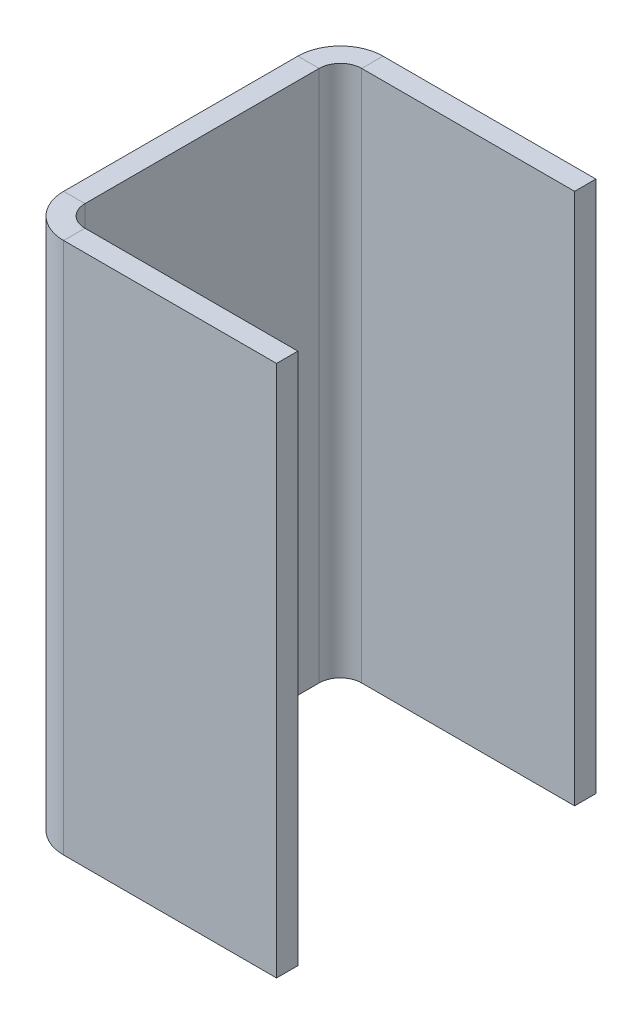
ISO-10303-21;
HEADER;
FILE_DESCRIPTION(('STEP AP214'),'2;1');
FILE_NAME('part.step','',(''),(''),'','','');
FILE_SCHEMA(('AUTOMOTIVE_DESIGN { 1 0 10303 214 1 1 1 1 }'));
ENDSEC;
DATA;
#1=APPLICATION_CONTEXT('core data for automotive mechanical design processes');
#2=APPLICATION_PROTOCOL_DEFINITION('international standard','automotive_design',2000,#1);
#3=PRODUCT_CONTEXT('',#1,'mechanical');
#4=PRODUCT('Part','Part','',(#3));
#5=PRODUCT_RELATED_PRODUCT_CATEGORY('part','',(#4));
#6=PRODUCT_DEFINITION_FORMATION('','',#4);
#7=PRODUCT_DEFINITION_CONTEXT('part definition',#1,'design');
#8=PRODUCT_DEFINITION('design','',#6,#7);
#9=PRODUCT_DEFINITION_SHAPE('','',#8);
#10=(LENGTH_UNIT() NAMED_UNIT(*) SI_UNIT(.MILLI.,.METRE.));
#11=(NAMED_UNIT(*) PLANE_ANGLE_UNIT() SI_UNIT($,.RADIAN.));
#12=(NAMED_UNIT(*) SI_UNIT($,.STERADIAN.) SOLID_ANGLE_UNIT());
#13=UNCERTAINTY_MEASURE_WITH_UNIT(LENGTH_MEASURE(1.E-05),#10,'distance_accuracy_value','');
#14=(GEOMETRIC_REPRESENTATION_CONTEXT(3) GLOBAL_UNCERTAINTY_ASSIGNED_CONTEXT((#13)) GLOBAL_UNIT_ASSIGNED_CONTEXT((#10,
#11,#12)) REPRESENTATION_CONTEXT('',''));
#15=CARTESIAN_POINT('',(0.,0.,0.));
#16=DIRECTION('',(0.,0.,1.));
#17=DIRECTION('',(1.,0.,0.));
#18=AXIS2_PLACEMENT_3D('',#15,#16,#17);
#19=CARTESIAN_POINT('',(-930.000000000004,-16.5000000000063,-525.));
#20=DIRECTION('',(0.,1.,0.));
#21=DIRECTION('',(0.,0.,1.));
#22=AXIS2_PLACEMENT_3D('',#19,#20,#21);
#23=PLANE('',#22);
#24=DIRECTION('',(1.,0.,0.));
#25=VECTOR('',#24,1.);
#26=CARTESIAN_POINT('',(-932.000000000004,-16.5000000000063,-525.));
#27=LINE('',#26,#25);
#28=CARTESIAN_POINT('',(-934.000000000004,-16.5000000000063,-525.));
#29=VERTEX_POINT('',#28);
#30=CARTESIAN_POINT('',(-932.000000000004,-16.5000000000063,-525.));
#31=VERTEX_POINT('',#30);
#32=EDGE_CURVE('E11',#29,#31,#27,.T.);
#33=ORIENTED_EDGE('',*,*,#32,.F.);
#34=CARTESIAN_POINT('',(-930.000000000004,-16.5000000000063,-525.));
#35=DIRECTION('',(0.,-1.,0.));
#36=DIRECTION('',(0.,0.,-1.));
#37=AXIS2_PLACEMENT_3D('',#34,#35,#36);
#38=CIRCLE('',#37,4.00000000000002);
#39=CARTESIAN_POINT('',(-930.000000425374,-16.5000000000063,-529.));
#40=VERTEX_POINT('',#39);
#41=EDGE_CURVE('E103',#29,#40,#38,.T.);
#42=ORIENTED_EDGE('',*,*,#41,.T.);
#43=DIRECTION('',(0.,0.,1.));
#44=VECTOR('',#43,1.);
#45=CARTESIAN_POINT('',(-930.000000425374,-16.5000000000063,-527.));
#46=LINE('',#45,#44);
#47=CARTESIAN_POINT('',(-930.000000425374,-16.5000000000063,-527.));
#48=VERTEX_POINT('',#47);
#49=EDGE_CURVE('E51',#40,#48,#46,.T.);
#50=ORIENTED_EDGE('',*,*,#49,.T.);
#51=CARTESIAN_POINT('',(-930.000000000004,-16.5000000000063,-525.));
#52=DIRECTION('',(0.,-1.,0.));
#53=DIRECTION('',(0.,0.,1.));
#54=AXIS2_PLACEMENT_3D('',#51,#52,#53);
#55=CIRCLE('',#54,2.00000000000002);
#56=EDGE_CURVE('E106',#31,#48,#55,.T.);
#57=ORIENTED_EDGE('',*,*,#56,.F.);
#58=EDGE_LOOP('',(#33,#42,#50,#57));
#59=FACE_BOUND('',#58,.T.);
#60=ADVANCED_FACE('F41',(#59),#23,.F.);
#61=CARTESIAN_POINT('',(-930.000000425374,-16.5000000000063,-527.));
#62=DIRECTION('',(0.,-1.,0.));
#63=DIRECTION('',(1.,0.,0.));
#64=AXIS2_PLACEMENT_3D('',#61,#62,#63);
#65=PLANE('',#64);
#66=ORIENTED_EDGE('',*,*,#49,.F.);
#67=DIRECTION('',(-1.,0.,0.));
#68=VECTOR('',#67,1.);
#69=CARTESIAN_POINT('',(-930.000000425374,-16.5000000000063,-529.));
#70=LINE('',#69,#68);
#71=CARTESIAN_POINT('',(-910.000000000005,-16.5000000000063,-529.));
#72=VERTEX_POINT('',#71);
#73=EDGE_CURVE('E141',#40,#72,#70,.F.);
#74=ORIENTED_EDGE('',*,*,#73,.T.);
#75=DIRECTION('',(0.,0.,1.));
#76=VECTOR('',#75,1.);
#77=CARTESIAN_POINT('',(-910.000000000005,-16.5000000000063,-527.));
#78=LINE('',#77,#76);
#79=CARTESIAN_POINT('',(-910.000000000005,-16.5000000000063,-527.));
#80=VERTEX_POINT('',#79);
#81=EDGE_CURVE('E169',#72,#80,#78,.T.);
#82=ORIENTED_EDGE('',*,*,#81,.T.);
#83=DIRECTION('',(1.,0.,0.));
#84=VECTOR('',#83,1.);
#85=CARTESIAN_POINT('',(-930.000000425374,-16.5000000000063,-527.));
#86=LINE('',#85,#84);
#87=EDGE_CURVE('E191',#48,#80,#86,.T.);
#88=ORIENTED_EDGE('',*,*,#87,.F.);
#89=EDGE_LOOP('',(#66,#74,#82,#88));
#90=FACE_BOUND('',#89,.T.);
#91=ADVANCED_FACE('F192',(#90),#65,.T.);
#92=CARTESIAN_POINT('',(-910.000000000005,33.4999999999937,-527.));
#93=DIRECTION('',(1.,0.,0.));
#94=DIRECTION('',(0.,1.,0.));
#95=AXIS2_PLACEMENT_3D('',#92,#93,#94);
#96=PLANE('',#95);
#97=ORIENTED_EDGE('',*,*,#81,.F.);
#98=DIRECTION('',(0.,1.,0.));
#99=VECTOR('',#98,1.);
#100=CARTESIAN_POINT('',(-910.000000000005,33.4999999999937,-529.));
#101=LINE('',#100,#99);
#102=CARTESIAN_POINT('',(-910.000000000005,33.4999999999955,-529.));
#103=VERTEX_POINT('',#102);
#104=EDGE_CURVE('E283',#72,#103,#101,.T.);
#105=ORIENTED_EDGE('',*,*,#104,.T.);
#106=DIRECTION('',(0.,0.,1.));
#107=VECTOR('',#106,1.);
#108=CARTESIAN_POINT('',(-910.000000000005,33.4999999999955,-527.));
#109=LINE('',#108,#107);
#110=CARTESIAN_POINT('',(-910.000000000005,33.4999999999955,-527.));
#111=VERTEX_POINT('',#110);
#112=EDGE_CURVE('E166',#103,#111,#109,.T.);
#113=ORIENTED_EDGE('',*,*,#112,.T.);
#114=DIRECTION('',(0.,1.,0.));
#115=VECTOR('',#114,1.);
#116=CARTESIAN_POINT('',(-910.000000000005,33.4999999999937,-527.));
#117=LINE('',#116,#115);
#118=EDGE_CURVE('E208',#80,#111,#117,.T.);
#119=ORIENTED_EDGE('',*,*,#118,.F.);
#120=EDGE_LOOP('',(#97,#105,#113,#119));
#121=FACE_BOUND('',#120,.T.);
#122=ADVANCED_FACE('F289',(#121),#96,.T.);
#123=CARTESIAN_POINT('',(-930.000000425374,33.4999999999937,-527.));
#124=DIRECTION('',(0.,-1.,0.));
#125=DIRECTION('',(1.,0.,0.));
#126=AXIS2_PLACEMENT_3D('',#123,#124,#125);
#127=PLANE('',#126);
#128=ORIENTED_EDGE('',*,*,#112,.F.);
#129=DIRECTION('',(-1.,0.,0.));
#130=VECTOR('',#129,1.);
#131=CARTESIAN_POINT('',(-930.000000425374,33.4999999999937,-529.));
#132=LINE('',#131,#130);
#133=CARTESIAN_POINT('',(-930.000000425374,33.4999999999937,-529.));
#134=VERTEX_POINT('',#133);
#135=EDGE_CURVE('E258',#134,#103,#132,.F.);
#136=ORIENTED_EDGE('',*,*,#135,.F.);
#137=DIRECTION('',(2.12684814204773E-07,0.,0.999999999999977));
#138=VECTOR('',#137,1.);
#139=CARTESIAN_POINT('',(-930.000000425374,33.4999999999937,-527.));
#140=LINE('',#139,#138);
#141=CARTESIAN_POINT('',(-930.000000425374,33.4999999999937,-527.));
#142=VERTEX_POINT('',#141);
#143=EDGE_CURVE('E163',#134,#142,#140,.T.);
#144=ORIENTED_EDGE('',*,*,#143,.T.);
#145=DIRECTION('',(1.,0.,0.));
#146=VECTOR('',#145,1.);
#147=CARTESIAN_POINT('',(-930.000000425374,33.4999999999937,-527.));
#148=LINE('',#147,#146);
#149=EDGE_CURVE('E202',#142,#111,#148,.T.);
#150=ORIENTED_EDGE('',*,*,#149,.T.);
#151=EDGE_LOOP('',(#128,#136,#144,#150));
#152=FACE_BOUND('',#151,.T.);
#153=ADVANCED_FACE('F294',(#152),#127,.F.);
#154=CARTESIAN_POINT('',(-930.000000000004,33.4999999999937,-525.));
#155=DIRECTION('',(0.,1.,0.));
#156=DIRECTION('',(0.,0.,1.));
#157=AXIS2_PLACEMENT_3D('',#154,#155,#156);
#158=PLANE('',#157);
#159=ORIENTED_EDGE('',*,*,#143,.F.);
#160=CARTESIAN_POINT('',(-930.000000000004,33.4999999999937,-525.));
#161=DIRECTION('',(0.,-1.,0.));
#162=DIRECTION('',(0.,0.,-1.));
#163=AXIS2_PLACEMENT_3D('',#160,#161,#162);
#164=CIRCLE('',#163,4.00000000000002);
#165=CARTESIAN_POINT('',(-934.000000000004,33.4999999999937,-525.));
#166=VERTEX_POINT('',#165);
#167=EDGE_CURVE('E134',#166,#134,#164,.T.);
#168=ORIENTED_EDGE('',*,*,#167,.F.);
#169=DIRECTION('',(1.,0.,0.));
#170=VECTOR('',#169,1.);
#171=CARTESIAN_POINT('',(-932.000000000004,33.4999999999937,-525.));
#172=LINE('',#171,#170);
#173=CARTESIAN_POINT('',(-932.000000000004,33.4999999999937,-525.));
#174=VERTEX_POINT('',#173);
#175=EDGE_CURVE('E160',#166,#174,#172,.T.);
#176=ORIENTED_EDGE('',*,*,#175,.T.);
#177=CARTESIAN_POINT('',(-930.000000000004,33.4999999999937,-525.));
#178=DIRECTION('',(0.,-1.,0.));
#179=DIRECTION('',(0.,0.,1.));
#180=AXIS2_PLACEMENT_3D('',#177,#178,#179);
#181=CIRCLE('',#180,2.00000000000002);
#182=EDGE_CURVE('E187',#174,#142,#181,.T.);
#183=ORIENTED_EDGE('',*,*,#182,.T.);
#184=EDGE_LOOP('',(#159,#168,#176,#183));
#185=FACE_BOUND('',#184,.T.);
#186=ADVANCED_FACE('F339',(#185),#158,.T.);
#187=CARTESIAN_POINT('',(-932.000000000004,33.4999999999937,-525.));
#188=DIRECTION('',(0.,-1.,0.));
#189=DIRECTION('',(0.,0.,-1.));
#190=AXIS2_PLACEMENT_3D('',#187,#188,#189);
#191=PLANE('',#190);
#192=ORIENTED_EDGE('',*,*,#175,.F.);
#193=DIRECTION('',(0.,0.,1.));
#194=VECTOR('',#193,1.);
#195=CARTESIAN_POINT('',(-934.000000000004,33.4999999999938,-525.));
#196=LINE('',#195,#194);
#197=CARTESIAN_POINT('',(-934.000000000004,33.4999999999938,-503.));
#198=VERTEX_POINT('',#197);
#199=EDGE_CURVE('E122',#198,#166,#196,.F.);
#200=ORIENTED_EDGE('',*,*,#199,.F.);
#201=DIRECTION('',(1.,0.,0.));
#202=VECTOR('',#201,1.);
#203=CARTESIAN_POINT('',(-932.000000000005,33.4999999999938,-503.));
#204=LINE('',#203,#202);
#205=CARTESIAN_POINT('',(-932.000000000005,33.4999999999938,-503.));
#206=VERTEX_POINT('',#205);
#207=EDGE_CURVE('E157',#198,#206,#204,.T.);
#208=ORIENTED_EDGE('',*,*,#207,.T.);
#209=DIRECTION('',(0.,0.,-1.));
#210=VECTOR('',#209,1.);
#211=CARTESIAN_POINT('',(-932.000000000004,33.4999999999937,-525.));
#212=LINE('',#211,#210);
#213=EDGE_CURVE('E216',#206,#174,#212,.T.);
#214=ORIENTED_EDGE('',*,*,#213,.T.);
#215=EDGE_LOOP('',(#192,#200,#208,#214));
#216=FACE_BOUND('',#215,.T.);
#217=ADVANCED_FACE('F336',(#216),#191,.F.);
#218=CARTESIAN_POINT('',(-930.000000000004,33.4999999999938,-503.));
#219=DIRECTION('',(0.,1.,0.));
#220=DIRECTION('',(0.,0.,1.));
#221=AXIS2_PLACEMENT_3D('',#218,#219,#220);
#222=PLANE('',#221);
#223=ORIENTED_EDGE('',*,*,#207,.F.);
#224=CARTESIAN_POINT('',(-930.000000000004,33.4999999999938,-503.));
#225=DIRECTION('',(0.,-1.,0.));
#226=DIRECTION('',(0.,0.,-1.));
#227=AXIS2_PLACEMENT_3D('',#224,#225,#226);
#228=CIRCLE('',#227,4.00000000000002);
#229=CARTESIAN_POINT('',(-930.000000425374,33.4999999999938,-499.));
#230=VERTEX_POINT('',#229);
#231=EDGE_CURVE('E262',#230,#198,#228,.T.);
#232=ORIENTED_EDGE('',*,*,#231,.F.);
#233=DIRECTION('',(0.,0.,-1.));
#234=VECTOR('',#233,1.);
#235=CARTESIAN_POINT('',(-930.000000425374,33.4999999999938,-501.));
#236=LINE('',#235,#234);
#237=CARTESIAN_POINT('',(-930.000000425374,33.4999999999938,-501.));
#238=VERTEX_POINT('',#237);
#239=EDGE_CURVE('E155',#230,#238,#236,.T.);
#240=ORIENTED_EDGE('',*,*,#239,.T.);
#241=CARTESIAN_POINT('',(-930.000000000004,33.4999999999938,-503.));
#242=DIRECTION('',(0.,-1.,0.));
#243=DIRECTION('',(0.,0.,-1.));
#244=AXIS2_PLACEMENT_3D('',#241,#242,#243);
#245=CIRCLE('',#244,2.00000000000002);
#246=EDGE_CURVE('E244',#238,#206,#245,.T.);
#247=ORIENTED_EDGE('',*,*,#246,.T.);
#248=EDGE_LOOP('',(#223,#232,#240,#247));
#249=FACE_BOUND('',#248,.T.);
#250=ADVANCED_FACE('F323',(#249),#222,.T.);
#251=CARTESIAN_POINT('',(-930.000000425374,33.4999999999938,-501.));
#252=DIRECTION('',(0.,-1.,0.));
#253=DIRECTION('',(-1.,0.,0.));
#254=AXIS2_PLACEMENT_3D('',#251,#252,#253);
#255=PLANE('',#254);
#256=ORIENTED_EDGE('',*,*,#239,.F.);
#257=DIRECTION('',(-1.,0.,0.));
#258=VECTOR('',#257,1.);
#259=CARTESIAN_POINT('',(-930.000000425374,33.4999999999955,-499.));
#260=LINE('',#259,#258);
#261=CARTESIAN_POINT('',(-910.000000000004,33.4999999999955,-499.));
#262=VERTEX_POINT('',#261);
#263=EDGE_CURVE('E253',#262,#230,#260,.T.);
#264=ORIENTED_EDGE('',*,*,#263,.F.);
#265=DIRECTION('',(0.,0.,-1.));
#266=VECTOR('',#265,1.);
#267=CARTESIAN_POINT('',(-910.000000000004,33.4999999999955,-501.));
#268=LINE('',#267,#266);
#269=CARTESIAN_POINT('',(-910.000000000004,33.4999999999955,-501.));
#270=VERTEX_POINT('',#269);
#271=EDGE_CURVE('E59',#262,#270,#268,.T.);
#272=ORIENTED_EDGE('',*,*,#271,.T.);
#273=DIRECTION('',(-1.,0.,0.));
#274=VECTOR('',#273,1.);
#275=CARTESIAN_POINT('',(-930.000000425374,33.4999999999938,-501.));
#276=LINE('',#275,#274);
#277=EDGE_CURVE('E237',#270,#238,#276,.T.);
#278=ORIENTED_EDGE('',*,*,#277,.T.);
#279=EDGE_LOOP('',(#256,#264,#272,#278));
#280=FACE_BOUND('',#279,.T.);
#281=ADVANCED_FACE('F326',(#280),#255,.F.);
#282=CARTESIAN_POINT('',(-910.000000000004,33.4999999999938,-501.));
#283=DIRECTION('',(1.,0.,0.));
#284=DIRECTION('',(0.,-1.,0.));
#285=AXIS2_PLACEMENT_3D('',#282,#283,#284);
#286=PLANE('',#285);
#287=ORIENTED_EDGE('',*,*,#271,.F.);
#288=DIRECTION('',(0.,-1.,0.));
#289=VECTOR('',#288,1.);
#290=CARTESIAN_POINT('',(-910.000000000004,33.4999999999938,-499.));
#291=LINE('',#290,#289);
#292=CARTESIAN_POINT('',(-910.000000000005,-16.5000000000062,-499.));
#293=VERTEX_POINT('',#292);
#294=EDGE_CURVE('E266',#262,#293,#291,.T.);
#295=ORIENTED_EDGE('',*,*,#294,.T.);
#296=DIRECTION('',(0.,0.,-1.));
#297=VECTOR('',#296,1.);
#298=CARTESIAN_POINT('',(-910.000000000005,-16.5000000000062,-501.));
#299=LINE('',#298,#297);
#300=CARTESIAN_POINT('',(-910.000000000005,-16.5000000000062,-501.));
#301=VERTEX_POINT('',#300);
#302=EDGE_CURVE('E151',#293,#301,#299,.T.);
#303=ORIENTED_EDGE('',*,*,#302,.T.);
#304=DIRECTION('',(0.,-1.,0.));
#305=VECTOR('',#304,1.);
#306=CARTESIAN_POINT('',(-910.000000000004,33.4999999999938,-501.));
#307=LINE('',#306,#305);
#308=EDGE_CURVE('E225',#270,#301,#307,.T.);
#309=ORIENTED_EDGE('',*,*,#308,.F.);
#310=EDGE_LOOP('',(#287,#295,#303,#309));
#311=FACE_BOUND('',#310,.T.);
#312=ADVANCED_FACE('F328',(#311),#286,.T.);
#313=CARTESIAN_POINT('',(-930.000000425374,-16.5000000000062,-501.));
#314=DIRECTION('',(0.,-1.,0.));
#315=DIRECTION('',(-1.,0.,0.));
#316=AXIS2_PLACEMENT_3D('',#313,#314,#315);
#317=PLANE('',#316);
#318=ORIENTED_EDGE('',*,*,#302,.F.);
#319=DIRECTION('',(-1.,0.,0.));
#320=VECTOR('',#319,1.);
#321=CARTESIAN_POINT('',(-930.000000425374,-16.5000000000062,-499.));
#322=LINE('',#321,#320);
#323=CARTESIAN_POINT('',(-930.000000425374,-16.5000000000062,-499.));
#324=VERTEX_POINT('',#323);
#325=EDGE_CURVE('E254',#293,#324,#322,.T.);
#326=ORIENTED_EDGE('',*,*,#325,.T.);
#327=DIRECTION('',(2.12684814204773E-07,0.,-0.999999999999977));
#328=VECTOR('',#327,1.);
#329=CARTESIAN_POINT('',(-930.000000425374,-16.5000000000062,-501.));
#330=LINE('',#329,#328);
#331=CARTESIAN_POINT('',(-930.000000425374,-16.5000000000062,-501.));
#332=VERTEX_POINT('',#331);
#333=EDGE_CURVE('E148',#324,#332,#330,.T.);
#334=ORIENTED_EDGE('',*,*,#333,.T.);
#335=DIRECTION('',(-1.,0.,0.));
#336=VECTOR('',#335,1.);
#337=CARTESIAN_POINT('',(-930.000000425374,-16.5000000000062,-501.));
#338=LINE('',#337,#336);
#339=EDGE_CURVE('E229',#301,#332,#338,.T.);
#340=ORIENTED_EDGE('',*,*,#339,.F.);
#341=EDGE_LOOP('',(#318,#326,#334,#340));
#342=FACE_BOUND('',#341,.T.);
#343=ADVANCED_FACE('F309',(#342),#317,.T.);
#344=CARTESIAN_POINT('',(-930.000000000004,-16.5000000000062,-503.));
#345=DIRECTION('',(0.,1.,0.));
#346=DIRECTION('',(0.,0.,1.));
#347=AXIS2_PLACEMENT_3D('',#344,#345,#346);
#348=PLANE('',#347);
#349=ORIENTED_EDGE('',*,*,#333,.F.);
#350=CARTESIAN_POINT('',(-930.000000000004,-16.5000000000062,-503.));
#351=DIRECTION('',(0.,-1.,0.));
#352=DIRECTION('',(0.,0.,-1.));
#353=AXIS2_PLACEMENT_3D('',#350,#351,#352);
#354=CIRCLE('',#353,4.00000000000002);
#355=CARTESIAN_POINT('',(-934.000000000005,-16.5000000000062,-503.));
#356=VERTEX_POINT('',#355);
#357=EDGE_CURVE('E259',#324,#356,#354,.T.);
#358=ORIENTED_EDGE('',*,*,#357,.T.);
#359=DIRECTION('',(1.,0.,0.));
#360=VECTOR('',#359,1.);
#361=CARTESIAN_POINT('',(-932.000000000005,-16.5000000000062,-503.));
#362=LINE('',#361,#360);
#363=CARTESIAN_POINT('',(-932.000000000005,-16.5000000000062,-503.));
#364=VERTEX_POINT('',#363);
#365=EDGE_CURVE('E45',#356,#364,#362,.T.);
#366=ORIENTED_EDGE('',*,*,#365,.T.);
#367=CARTESIAN_POINT('',(-930.000000000004,-16.5000000000062,-503.));
#368=DIRECTION('',(0.,-1.,0.));
#369=DIRECTION('',(0.,0.,-1.));
#370=AXIS2_PLACEMENT_3D('',#367,#368,#369);
#371=CIRCLE('',#370,2.00000000000002);
#372=EDGE_CURVE('E240',#332,#364,#371,.T.);
#373=ORIENTED_EDGE('',*,*,#372,.F.);
#374=EDGE_LOOP('',(#349,#358,#366,#373));
#375=FACE_BOUND('',#374,.T.);
#376=ADVANCED_FACE('F317',(#375),#348,.F.);
#377=CARTESIAN_POINT('',(-932.000000000004,-16.5000000000063,-525.));
#378=DIRECTION('',(0.,-1.,0.));
#379=DIRECTION('',(0.,0.,-1.));
#380=AXIS2_PLACEMENT_3D('',#377,#378,#379);
#381=PLANE('',#380);
#382=DIRECTION('',(0.,0.,1.));
#383=VECTOR('',#382,1.);
#384=CARTESIAN_POINT('',(-934.000000000004,-16.5000000000062,-525.));
#385=LINE('',#384,#383);
#386=EDGE_CURVE('E119',#356,#29,#385,.F.);
#387=ORIENTED_EDGE('',*,*,#386,.T.);
#388=ORIENTED_EDGE('',*,*,#32,.T.);
#389=DIRECTION('',(0.,0.,-1.));
#390=VECTOR('',#389,1.);
#391=CARTESIAN_POINT('',(-932.000000000004,-16.5000000000063,-525.));
#392=LINE('',#391,#390);
#393=EDGE_CURVE('E197',#364,#31,#392,.T.);
#394=ORIENTED_EDGE('',*,*,#393,.F.);
#395=ORIENTED_EDGE('',*,*,#365,.F.);
#396=EDGE_LOOP('',(#387,#388,#394,#395));
#397=FACE_BOUND('',#396,.T.);
#398=ADVANCED_FACE('F43',(#397),#381,.T.);
#399=CARTESIAN_POINT('',(-930.000000000004,33.4999999999938,-503.));
#400=DIRECTION('',(0.,-1.,0.));
#401=DIRECTION('',(0.,0.,1.));
#402=AXIS2_PLACEMENT_3D('',#399,#400,#401);
#403=CYLINDRICAL_SURFACE('',#402,2.00000000000002);
#404=ORIENTED_EDGE('',*,*,#372,.T.);
#405=DIRECTION('',(0.,-1.,0.));
#406=VECTOR('',#405,1.);
#407=CARTESIAN_POINT('',(-932.000000000005,33.4999999999938,-503.));
#408=LINE('',#407,#406);
#409=EDGE_CURVE('E188',#206,#364,#408,.T.);
#410=ORIENTED_EDGE('',*,*,#409,.F.);
#411=ORIENTED_EDGE('',*,*,#246,.F.);
#412=DIRECTION('',(0.,-1.,0.));
#413=VECTOR('',#412,1.);
#414=CARTESIAN_POINT('',(-930.000000425374,33.4999999999938,-501.));
#415=LINE('',#414,#413);
#416=EDGE_CURVE('E233',#238,#332,#415,.T.);
#417=ORIENTED_EDGE('',*,*,#416,.T.);
#418=EDGE_LOOP('',(#404,#410,#411,#417));
#419=FACE_BOUND('',#418,.T.);
#420=ADVANCED_FACE('F321',(#419),#403,.F.);
#421=CARTESIAN_POINT('',(-930.000000425374,33.4999999999938,-501.));
#422=DIRECTION('',(0.,0.,-1.));
#423=DIRECTION('',(0.,-1.,0.));
#424=AXIS2_PLACEMENT_3D('',#421,#422,#423);
#425=PLANE('',#424);
#426=ORIENTED_EDGE('',*,*,#308,.T.);
#427=ORIENTED_EDGE('',*,*,#339,.T.);
#428=ORIENTED_EDGE('',*,*,#416,.F.);
#429=ORIENTED_EDGE('',*,*,#277,.F.);
#430=EDGE_LOOP('',(#426,#427,#428,#429));
#431=FACE_BOUND('',#430,.T.);
#432=ADVANCED_FACE('F315',(#431),#425,.T.);
#433=CARTESIAN_POINT('',(-930.000000000004,33.4999999999937,-525.));
#434=DIRECTION('',(0.,-1.,0.));
#435=DIRECTION('',(0.,0.,1.));
#436=AXIS2_PLACEMENT_3D('',#433,#434,#435);
#437=CYLINDRICAL_SURFACE('',#436,2.00000000000002);
#438=ORIENTED_EDGE('',*,*,#56,.T.);
#439=DIRECTION('',(0.,-1.,0.));
#440=VECTOR('',#439,1.);
#441=CARTESIAN_POINT('',(-930.000000425374,33.4999999999937,-527.));
#442=LINE('',#441,#440);
#443=EDGE_CURVE('E183',#142,#48,#442,.T.);
#444=ORIENTED_EDGE('',*,*,#443,.F.);
#445=ORIENTED_EDGE('',*,*,#182,.F.);
#446=DIRECTION('',(0.,-1.,0.));
#447=VECTOR('',#446,1.);
#448=CARTESIAN_POINT('',(-932.000000000004,33.4999999999937,-525.));
#449=LINE('',#448,#447);
#450=EDGE_CURVE('E185',#174,#31,#449,.T.);
#451=ORIENTED_EDGE('',*,*,#450,.T.);
#452=EDGE_LOOP('',(#438,#444,#445,#451));
#453=FACE_BOUND('',#452,.T.);
#454=ADVANCED_FACE('F180',(#453),#437,.F.);
#455=CARTESIAN_POINT('',(-932.000000000004,33.4999999999937,-525.));
#456=DIRECTION('',(1.,0.,0.));
#457=DIRECTION('',(0.,0.,1.));
#458=AXIS2_PLACEMENT_3D('',#455,#456,#457);
#459=PLANE('',#458);
#460=ORIENTED_EDGE('',*,*,#393,.T.);
#461=ORIENTED_EDGE('',*,*,#450,.F.);
#462=ORIENTED_EDGE('',*,*,#213,.F.);
#463=ORIENTED_EDGE('',*,*,#409,.T.);
#464=EDGE_LOOP('',(#460,#461,#462,#463));
#465=FACE_BOUND('',#464,.T.);
#466=ADVANCED_FACE('F535',(#465),#459,.T.);
#467=CARTESIAN_POINT('',(-930.000000425374,33.4999999999937,-527.));
#468=DIRECTION('',(0.,0.,1.));
#469=DIRECTION('',(0.,1.,0.));
#470=AXIS2_PLACEMENT_3D('',#467,#468,#469);
#471=PLANE('',#470);
#472=ORIENTED_EDGE('',*,*,#118,.T.);
#473=ORIENTED_EDGE('',*,*,#149,.F.);
#474=ORIENTED_EDGE('',*,*,#443,.T.);
#475=ORIENTED_EDGE('',*,*,#87,.T.);
#476=EDGE_LOOP('',(#472,#473,#474,#475));
#477=FACE_BOUND('',#476,.T.);
#478=ADVANCED_FACE('F200',(#477),#471,.T.);
#479=CARTESIAN_POINT('',(-930.000000000004,33.4999999999938,-503.));
#480=DIRECTION('',(0.,-1.,0.));
#481=DIRECTION('',(0.,0.,1.));
#482=AXIS2_PLACEMENT_3D('',#479,#480,#481);
#483=CYLINDRICAL_SURFACE('',#482,4.00000000000002);
#484=ORIENTED_EDGE('',*,*,#357,.F.);
#485=DIRECTION('',(0.,-1.,0.));
#486=VECTOR('',#485,1.);
#487=CARTESIAN_POINT('',(-930.000000850744,33.4999999999938,-499.));
#488=LINE('',#487,#486);
#489=EDGE_CURVE('E250',#230,#324,#488,.T.);
#490=ORIENTED_EDGE('',*,*,#489,.F.);
#491=ORIENTED_EDGE('',*,*,#231,.T.);
#492=DIRECTION('',(0.,-1.,0.));
#493=VECTOR('',#492,1.);
#494=CARTESIAN_POINT('',(-934.000000000004,33.4999999999937,-503.));
#495=LINE('',#494,#493);
#496=EDGE_CURVE('E135',#198,#356,#495,.T.);
#497=ORIENTED_EDGE('',*,*,#496,.T.);
#498=EDGE_LOOP('',(#484,#490,#491,#497));
#499=FACE_BOUND('',#498,.T.);
#500=ADVANCED_FACE('F334',(#499),#483,.T.);
#501=CARTESIAN_POINT('',(-930.000000425374,33.4999999999938,-499.));
#502=DIRECTION('',(0.,0.,-1.));
#503=DIRECTION('',(0.,-1.,0.));
#504=AXIS2_PLACEMENT_3D('',#501,#502,#503);
#505=PLANE('',#504);
#506=ORIENTED_EDGE('',*,*,#294,.F.);
#507=ORIENTED_EDGE('',*,*,#263,.T.);
#508=ORIENTED_EDGE('',*,*,#489,.T.);
#509=ORIENTED_EDGE('',*,*,#325,.F.);
#510=EDGE_LOOP('',(#506,#507,#508,#509));
#511=FACE_BOUND('',#510,.T.);
#512=ADVANCED_FACE('F331',(#511),#505,.F.);
#513=CARTESIAN_POINT('',(-930.000000000004,33.4999999999937,-525.));
#514=DIRECTION('',(0.,-1.,0.));
#515=DIRECTION('',(0.,0.,1.));
#516=AXIS2_PLACEMENT_3D('',#513,#514,#515);
#517=CYLINDRICAL_SURFACE('',#516,4.00000000000002);
#518=ORIENTED_EDGE('',*,*,#41,.F.);
#519=DIRECTION('',(0.,-1.,0.));
#520=VECTOR('',#519,1.);
#521=CARTESIAN_POINT('',(-934.000000000004,33.4999999999937,-525.));
#522=LINE('',#521,#520);
#523=EDGE_CURVE('E116',#166,#29,#522,.T.);
#524=ORIENTED_EDGE('',*,*,#523,.F.);
#525=ORIENTED_EDGE('',*,*,#167,.T.);
#526=DIRECTION('',(0.,1.,0.));
#527=VECTOR('',#526,1.);
#528=CARTESIAN_POINT('',(-930.000000425374,33.4999999999937,-529.));
#529=LINE('',#528,#527);
#530=EDGE_CURVE('E131',#134,#40,#529,.F.);
#531=ORIENTED_EDGE('',*,*,#530,.T.);
#532=EDGE_LOOP('',(#518,#524,#525,#531));
#533=FACE_BOUND('',#532,.T.);
#534=ADVANCED_FACE('F129',(#533),#517,.T.);
#535=CARTESIAN_POINT('',(-934.000000000004,33.4999999999937,-525.));
#536=DIRECTION('',(1.,0.,0.));
#537=DIRECTION('',(0.,0.,1.));
#538=AXIS2_PLACEMENT_3D('',#535,#536,#537);
#539=PLANE('',#538);
#540=ORIENTED_EDGE('',*,*,#386,.F.);
#541=ORIENTED_EDGE('',*,*,#496,.F.);
#542=ORIENTED_EDGE('',*,*,#199,.T.);
#543=ORIENTED_EDGE('',*,*,#523,.T.);
#544=EDGE_LOOP('',(#540,#541,#542,#543));
#545=FACE_BOUND('',#544,.T.);
#546=ADVANCED_FACE('F117',(#545),#539,.F.);
#547=CARTESIAN_POINT('',(-930.000000425374,33.4999999999937,-529.));
#548=DIRECTION('',(0.,0.,1.));
#549=DIRECTION('',(0.,1.,0.));
#550=AXIS2_PLACEMENT_3D('',#547,#548,#549);
#551=PLANE('',#550);
#552=ORIENTED_EDGE('',*,*,#104,.F.);
#553=ORIENTED_EDGE('',*,*,#73,.F.);
#554=ORIENTED_EDGE('',*,*,#530,.F.);
#555=ORIENTED_EDGE('',*,*,#135,.T.);
#556=EDGE_LOOP('',(#552,#553,#554,#555));
#557=FACE_BOUND('',#556,.T.);
#558=ADVANCED_FACE('F291',(#557),#551,.F.);
#559=CLOSED_SHELL('',(#60,#91,#122,#153,#186,#217,#250,#281,#312,#343,#376,#398,#420,#432,#454,
#466,#478,#500,#512,#534,#546,#558));
#560=MANIFOLD_SOLID_BREP('B2',#559);
#561=ADVANCED_BREP_SHAPE_REPRESENTATION('',(#18,#560),#14);
#562=SHAPE_DEFINITION_REPRESENTATION(#9,#561);
ENDSEC;
END-ISO-10303-21;
